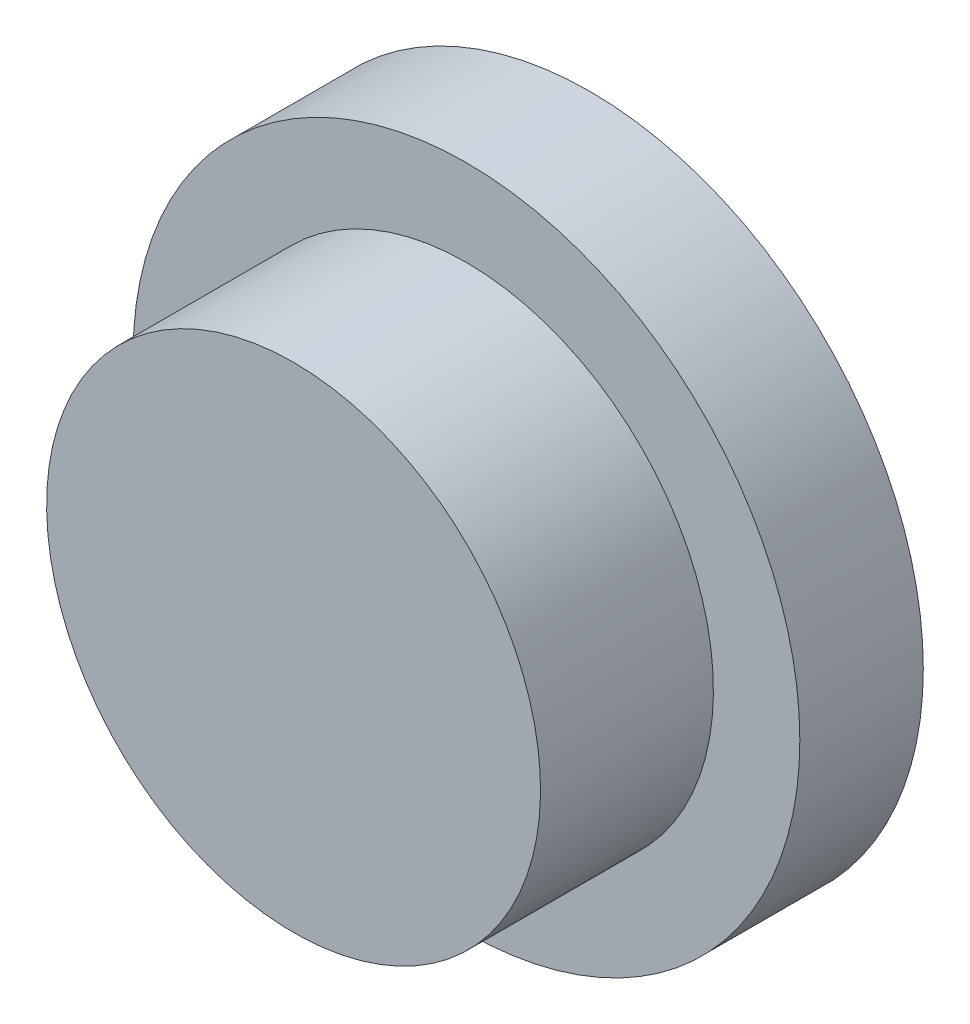
ISO-10303-21;
HEADER;
FILE_DESCRIPTION(('STEP AP214'),'2;1');
FILE_NAME('part.step','',(''),(''),'','','');
FILE_SCHEMA(('AUTOMOTIVE_DESIGN { 1 0 10303 214 1 1 1 1 }'));
ENDSEC;
DATA;
#1=APPLICATION_CONTEXT('core data for automotive mechanical design processes');
#2=APPLICATION_PROTOCOL_DEFINITION('international standard','automotive_design',2000,#1);
#3=PRODUCT_CONTEXT('',#1,'mechanical');
#4=PRODUCT('Part','Part','',(#3));
#5=PRODUCT_RELATED_PRODUCT_CATEGORY('part','',(#4));
#6=PRODUCT_DEFINITION_FORMATION('','',#4);
#7=PRODUCT_DEFINITION_CONTEXT('part definition',#1,'design');
#8=PRODUCT_DEFINITION('design','',#6,#7);
#9=PRODUCT_DEFINITION_SHAPE('','',#8);
#10=(LENGTH_UNIT() NAMED_UNIT(*) SI_UNIT(.MILLI.,.METRE.));
#11=(NAMED_UNIT(*) PLANE_ANGLE_UNIT() SI_UNIT($,.RADIAN.));
#12=(NAMED_UNIT(*) SI_UNIT($,.STERADIAN.) SOLID_ANGLE_UNIT());
#13=UNCERTAINTY_MEASURE_WITH_UNIT(LENGTH_MEASURE(1.E-05),#10,'distance_accuracy_value','');
#14=(GEOMETRIC_REPRESENTATION_CONTEXT(3) GLOBAL_UNCERTAINTY_ASSIGNED_CONTEXT((#13)) GLOBAL_UNIT_ASSIGNED_CONTEXT((#10,
#11,#12)) REPRESENTATION_CONTEXT('',''));
#15=CARTESIAN_POINT('',(0.,0.,0.));
#16=DIRECTION('',(0.,0.,1.));
#17=DIRECTION('',(1.,0.,0.));
#18=AXIS2_PLACEMENT_3D('',#15,#16,#17);
#19=CARTESIAN_POINT('',(0.,0.,-1.2));
#20=DIRECTION('',(0.,0.,-1.));
#21=DIRECTION('',(0.,1.,0.));
#22=AXIS2_PLACEMENT_3D('',#19,#20,#21);
#23=CONICAL_SURFACE('',#22,0.7,0.785398163397);
#24=CARTESIAN_POINT('',(0.,0.,-1.2));
#25=DIRECTION('',(0.,0.,-1.));
#26=DIRECTION('',(0.,1.,0.));
#27=AXIS2_PLACEMENT_3D('',#24,#25,#26);
#28=CIRCLE('',#27,0.7);
#29=CARTESIAN_POINT('',(0.,0.7,-1.2));
#30=VERTEX_POINT('',#29);
#31=EDGE_CURVE('E26',#30,#30,#28,.T.);
#32=ORIENTED_EDGE('',*,*,#31,.T.);
#33=DIRECTION('',(0.,-0.707106781186048,0.707106781187048));
#34=VECTOR('',#33,1.);
#35=CARTESIAN_POINT('',(0.,0.7,-1.2));
#36=LINE('',#35,#34);
#37=CARTESIAN_POINT('',(0.,0.,-0.499999999999));
#38=VERTEX_POINT('',#37);
#39=EDGE_CURVE('E11',#30,#38,#36,.T.);
#40=ORIENTED_EDGE('',*,*,#39,.T.);
#41=ORIENTED_EDGE('',*,*,#39,.F.);
#42=EDGE_LOOP('',(#32,#40,#41));
#43=FACE_BOUND('',#42,.T.);
#44=ADVANCED_FACE('F17',(#43),#23,.F.);
#45=CARTESIAN_POINT('',(0.,0.,-1.2));
#46=DIRECTION('',(0.,0.,1.));
#47=DIRECTION('',(1.,0.,0.));
#48=AXIS2_PLACEMENT_3D('',#45,#46,#47);
#49=PLANE('',#48);
#50=ORIENTED_EDGE('',*,*,#31,.F.);
#51=EDGE_LOOP('',(#50));
#52=FACE_BOUND('',#51,.T.);
#53=CARTESIAN_POINT('',(0.,0.,-1.2));
#54=DIRECTION('',(0.,0.,-1.));
#55=DIRECTION('',(0.,1.,0.));
#56=AXIS2_PLACEMENT_3D('',#53,#54,#55);
#57=CIRCLE('',#56,1.35);
#58=CARTESIAN_POINT('',(0.,1.35,-1.2));
#59=VERTEX_POINT('',#58);
#60=EDGE_CURVE('E79',#59,#59,#57,.T.);
#61=ORIENTED_EDGE('',*,*,#60,.T.);
#62=EDGE_LOOP('',(#61));
#63=FACE_BOUND('',#62,.T.);
#64=ADVANCED_FACE('F19',(#52,#63),#49,.F.);
#65=CARTESIAN_POINT('',(0.,0.,-0.7));
#66=DIRECTION('',(0.,0.,-1.));
#67=DIRECTION('',(0.,1.,0.));
#68=AXIS2_PLACEMENT_3D('',#65,#66,#67);
#69=CYLINDRICAL_SURFACE('',#68,1.35);
#70=CARTESIAN_POINT('',(0.,0.,-0.7));
#71=DIRECTION('',(0.,0.,-1.));
#72=DIRECTION('',(0.,1.,0.));
#73=AXIS2_PLACEMENT_3D('',#70,#71,#72);
#74=CIRCLE('',#73,1.35);
#75=CARTESIAN_POINT('',(0.,1.35,-0.7));
#76=VERTEX_POINT('',#75);
#77=EDGE_CURVE('E69',#76,#76,#74,.T.);
#78=ORIENTED_EDGE('',*,*,#77,.T.);
#79=DIRECTION('',(0.,0.,-1.));
#80=VECTOR('',#79,1.);
#81=CARTESIAN_POINT('',(0.,1.35,-0.7));
#82=LINE('',#81,#80);
#83=EDGE_CURVE('E75',#76,#59,#82,.T.);
#84=ORIENTED_EDGE('',*,*,#83,.T.);
#85=ORIENTED_EDGE('',*,*,#60,.F.);
#86=ORIENTED_EDGE('',*,*,#83,.F.);
#87=EDGE_LOOP('',(#78,#84,#85,#86));
#88=FACE_BOUND('',#87,.T.);
#89=ADVANCED_FACE('F87',(#88),#69,.T.);
#90=CARTESIAN_POINT('',(0.,0.,-0.7));
#91=DIRECTION('',(0.,0.,-1.));
#92=DIRECTION('',(0.,-1.,0.));
#93=AXIS2_PLACEMENT_3D('',#90,#91,#92);
#94=PLANE('',#93);
#95=ORIENTED_EDGE('',*,*,#77,.F.);
#96=EDGE_LOOP('',(#95));
#97=FACE_BOUND('',#96,.T.);
#98=CARTESIAN_POINT('',(0.,0.,-0.7));
#99=DIRECTION('',(0.,0.,-1.));
#100=DIRECTION('',(0.,1.,0.));
#101=AXIS2_PLACEMENT_3D('',#98,#99,#100);
#102=CIRCLE('',#101,1.);
#103=CARTESIAN_POINT('',(0.,1.,-0.7));
#104=VERTEX_POINT('',#103);
#105=EDGE_CURVE('E63',#104,#104,#102,.T.);
#106=ORIENTED_EDGE('',*,*,#105,.T.);
#107=EDGE_LOOP('',(#106));
#108=FACE_BOUND('',#107,.T.);
#109=ADVANCED_FACE('F97',(#97,#108),#94,.F.);
#110=CARTESIAN_POINT('',(0.,0.,0.));
#111=DIRECTION('',(0.,0.,-1.));
#112=DIRECTION('',(0.,1.,0.));
#113=AXIS2_PLACEMENT_3D('',#110,#111,#112);
#114=CYLINDRICAL_SURFACE('',#113,1.);
#115=CARTESIAN_POINT('',(0.,0.,0.));
#116=DIRECTION('',(0.,0.,-1.));
#117=DIRECTION('',(0.,1.,0.));
#118=AXIS2_PLACEMENT_3D('',#115,#116,#117);
#119=CIRCLE('',#118,1.);
#120=CARTESIAN_POINT('',(0.,1.,0.));
#121=VERTEX_POINT('',#120);
#122=EDGE_CURVE('E62',#121,#121,#119,.T.);
#123=ORIENTED_EDGE('',*,*,#122,.T.);
#124=DIRECTION('',(0.,0.,-1.));
#125=VECTOR('',#124,1.);
#126=CARTESIAN_POINT('',(0.,1.,0.));
#127=LINE('',#126,#125);
#128=EDGE_CURVE('E59',#121,#104,#127,.T.);
#129=ORIENTED_EDGE('',*,*,#128,.T.);
#130=ORIENTED_EDGE('',*,*,#105,.F.);
#131=ORIENTED_EDGE('',*,*,#128,.F.);
#132=EDGE_LOOP('',(#123,#129,#130,#131));
#133=FACE_BOUND('',#132,.T.);
#134=ADVANCED_FACE('F60',(#133),#114,.T.);
#135=CARTESIAN_POINT('',(0.,0.,0.));
#136=DIRECTION('',(0.,0.,-1.));
#137=DIRECTION('',(0.,-1.,0.));
#138=AXIS2_PLACEMENT_3D('',#135,#136,#137);
#139=PLANE('',#138);
#140=ORIENTED_EDGE('',*,*,#122,.F.);
#141=EDGE_LOOP('',(#140));
#142=FACE_BOUND('',#141,.T.);
#143=ADVANCED_FACE('F106',(#142),#139,.F.);
#144=CLOSED_SHELL('',(#44,#64,#89,#109,#134,#143));
#145=MANIFOLD_SOLID_BREP('B1',#144);
#146=ADVANCED_BREP_SHAPE_REPRESENTATION('',(#18,#145),#14);
#147=SHAPE_DEFINITION_REPRESENTATION(#9,#146);
ENDSEC;
END-ISO-10303-21;
